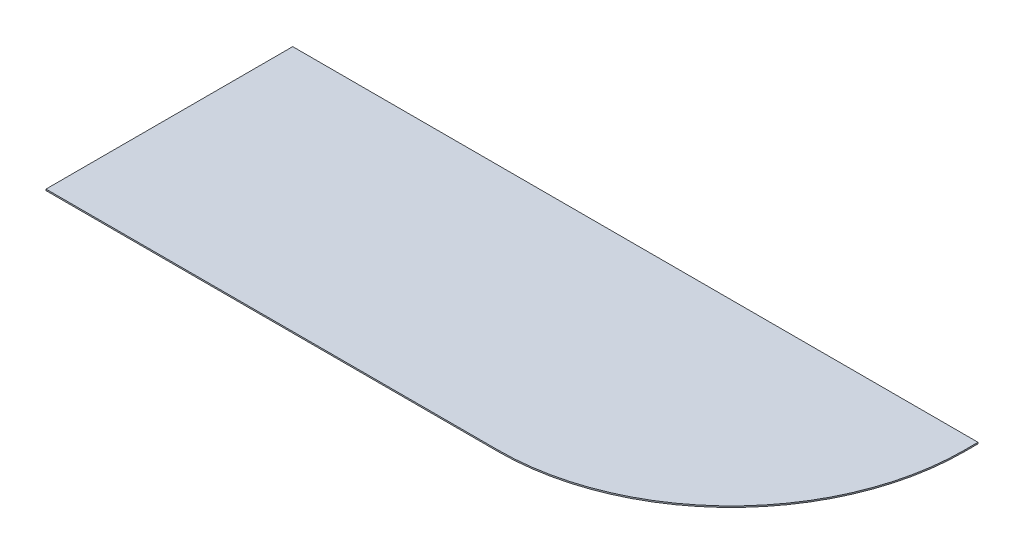
ISO-10303-21;
HEADER;
FILE_DESCRIPTION(('STEP AP214'),'2;1');
FILE_NAME('part.step','',(''),(''),'','','');
FILE_SCHEMA(('AUTOMOTIVE_DESIGN { 1 0 10303 214 1 1 1 1 }'));
ENDSEC;
DATA;
#1=APPLICATION_CONTEXT('core data for automotive mechanical design processes');
#2=APPLICATION_PROTOCOL_DEFINITION('international standard','automotive_design',2000,#1);
#3=PRODUCT_CONTEXT('',#1,'mechanical');
#4=PRODUCT('Part','Part','',(#3));
#5=PRODUCT_RELATED_PRODUCT_CATEGORY('part','',(#4));
#6=PRODUCT_DEFINITION_FORMATION('','',#4);
#7=PRODUCT_DEFINITION_CONTEXT('part definition',#1,'design');
#8=PRODUCT_DEFINITION('design','',#6,#7);
#9=PRODUCT_DEFINITION_SHAPE('','',#8);
#10=(LENGTH_UNIT() NAMED_UNIT(*) SI_UNIT(.MILLI.,.METRE.));
#11=(NAMED_UNIT(*) PLANE_ANGLE_UNIT() SI_UNIT($,.RADIAN.));
#12=(NAMED_UNIT(*) SI_UNIT($,.STERADIAN.) SOLID_ANGLE_UNIT());
#13=UNCERTAINTY_MEASURE_WITH_UNIT(LENGTH_MEASURE(1.E-05),#10,'distance_accuracy_value','');
#14=(GEOMETRIC_REPRESENTATION_CONTEXT(3) GLOBAL_UNCERTAINTY_ASSIGNED_CONTEXT((#13)) GLOBAL_UNIT_ASSIGNED_CONTEXT((#10,
#11,#12)) REPRESENTATION_CONTEXT('',''));
#15=CARTESIAN_POINT('',(0.,0.,0.));
#16=DIRECTION('',(0.,0.,1.));
#17=DIRECTION('',(1.,0.,0.));
#18=AXIS2_PLACEMENT_3D('',#15,#16,#17);
#19=CARTESIAN_POINT('',(0.,1.,0.));
#20=DIRECTION('',(-1.,0.,0.));
#21=DIRECTION('',(0.,0.,1.));
#22=AXIS2_PLACEMENT_3D('',#19,#20,#21);
#23=PLANE('',#22);
#24=DIRECTION('',(0.,0.,-1.));
#25=VECTOR('',#24,1.);
#26=CARTESIAN_POINT('',(0.,0.,0.));
#27=LINE('',#26,#25);
#28=CARTESIAN_POINT('',(0.,0.,9.99999999999879));
#29=VERTEX_POINT('',#28);
#30=CARTESIAN_POINT('',(0.,0.,0.));
#31=VERTEX_POINT('',#30);
#32=EDGE_CURVE('E122',#29,#31,#27,.T.);
#33=ORIENTED_EDGE('',*,*,#32,.T.);
#34=DIRECTION('',(0.,-1.,0.));
#35=VECTOR('',#34,1.);
#36=CARTESIAN_POINT('',(0.,1.,0.));
#37=LINE('',#36,#35);
#38=CARTESIAN_POINT('',(0.,1.,0.));
#39=VERTEX_POINT('',#38);
#40=EDGE_CURVE('E11',#39,#31,#37,.T.);
#41=ORIENTED_EDGE('',*,*,#40,.F.);
#42=DIRECTION('',(0.,0.,-1.));
#43=VECTOR('',#42,1.);
#44=CARTESIAN_POINT('',(0.,1.,0.));
#45=LINE('',#44,#43);
#46=CARTESIAN_POINT('',(0.,1.,9.99999999999879));
#47=VERTEX_POINT('',#46);
#48=EDGE_CURVE('E135',#47,#39,#45,.T.);
#49=ORIENTED_EDGE('',*,*,#48,.F.);
#50=DIRECTION('',(0.,-1.,0.));
#51=VECTOR('',#50,1.);
#52=CARTESIAN_POINT('',(0.,1.,9.99999999999879));
#53=LINE('',#52,#51);
#54=EDGE_CURVE('E118',#47,#29,#53,.T.);
#55=ORIENTED_EDGE('',*,*,#54,.T.);
#56=EDGE_LOOP('',(#33,#41,#49,#55));
#57=FACE_BOUND('',#56,.T.);
#58=ADVANCED_FACE('F43',(#57),#23,.F.);
#59=CARTESIAN_POINT('',(0.,1.,0.));
#60=DIRECTION('',(0.,0.,1.));
#61=DIRECTION('',(1.,0.,0.));
#62=AXIS2_PLACEMENT_3D('',#59,#60,#61);
#63=PLANE('',#62);
#64=DIRECTION('',(-1.,0.,0.));
#65=VECTOR('',#64,1.);
#66=CARTESIAN_POINT('',(0.,0.,0.));
#67=LINE('',#66,#65);
#68=CARTESIAN_POINT('',(-500.,0.,0.));
#69=VERTEX_POINT('',#68);
#70=EDGE_CURVE('E126',#31,#69,#67,.T.);
#71=ORIENTED_EDGE('',*,*,#70,.T.);
#72=DIRECTION('',(0.,-1.,0.));
#73=VECTOR('',#72,1.);
#74=CARTESIAN_POINT('',(-500.,1.,0.));
#75=LINE('',#74,#73);
#76=CARTESIAN_POINT('',(-500.,1.,0.));
#77=VERTEX_POINT('',#76);
#78=EDGE_CURVE('E52',#77,#69,#75,.T.);
#79=ORIENTED_EDGE('',*,*,#78,.F.);
#80=DIRECTION('',(-1.,0.,0.));
#81=VECTOR('',#80,1.);
#82=CARTESIAN_POINT('',(0.,1.,0.));
#83=LINE('',#82,#81);
#84=EDGE_CURVE('E94',#39,#77,#83,.T.);
#85=ORIENTED_EDGE('',*,*,#84,.F.);
#86=ORIENTED_EDGE('',*,*,#40,.T.);
#87=EDGE_LOOP('',(#71,#79,#85,#86));
#88=FACE_BOUND('',#87,.T.);
#89=ADVANCED_FACE('F157',(#88),#63,.F.);
#90=CARTESIAN_POINT('',(-500.,1.,0.));
#91=DIRECTION('',(1.,0.,0.));
#92=DIRECTION('',(0.,0.,-1.));
#93=AXIS2_PLACEMENT_3D('',#90,#91,#92);
#94=PLANE('',#93);
#95=DIRECTION('',(0.,0.,1.));
#96=VECTOR('',#95,1.);
#97=CARTESIAN_POINT('',(-500.,0.,0.));
#98=LINE('',#97,#96);
#99=CARTESIAN_POINT('',(-500.,0.,180.));
#100=VERTEX_POINT('',#99);
#101=EDGE_CURVE('E110',#69,#100,#98,.T.);
#102=ORIENTED_EDGE('',*,*,#101,.T.);
#103=DIRECTION('',(0.,-1.,0.));
#104=VECTOR('',#103,1.);
#105=CARTESIAN_POINT('',(-500.,1.,180.));
#106=LINE('',#105,#104);
#107=CARTESIAN_POINT('',(-500.,1.,180.));
#108=VERTEX_POINT('',#107);
#109=EDGE_CURVE('E107',#108,#100,#106,.T.);
#110=ORIENTED_EDGE('',*,*,#109,.F.);
#111=DIRECTION('',(0.,0.,1.));
#112=VECTOR('',#111,1.);
#113=CARTESIAN_POINT('',(-500.,1.,0.));
#114=LINE('',#113,#112);
#115=EDGE_CURVE('E98',#77,#108,#114,.T.);
#116=ORIENTED_EDGE('',*,*,#115,.F.);
#117=ORIENTED_EDGE('',*,*,#78,.T.);
#118=EDGE_LOOP('',(#102,#110,#116,#117));
#119=FACE_BOUND('',#118,.T.);
#120=ADVANCED_FACE('F108',(#119),#94,.F.);
#121=CARTESIAN_POINT('',(-170.000000000001,1.,180.));
#122=DIRECTION('',(0.,0.,-1.));
#123=DIRECTION('',(-1.,0.,0.));
#124=AXIS2_PLACEMENT_3D('',#121,#122,#123);
#125=PLANE('',#124);
#126=DIRECTION('',(1.,0.,0.));
#127=VECTOR('',#126,1.);
#128=CARTESIAN_POINT('',(-170.000000000001,0.,180.));
#129=LINE('',#128,#127);
#130=CARTESIAN_POINT('',(-170.000000000001,0.,180.));
#131=VERTEX_POINT('',#130);
#132=EDGE_CURVE('E80',#100,#131,#129,.T.);
#133=ORIENTED_EDGE('',*,*,#132,.T.);
#134=DIRECTION('',(0.,-1.,0.));
#135=VECTOR('',#134,1.);
#136=CARTESIAN_POINT('',(-170.000000000001,1.,180.));
#137=LINE('',#136,#135);
#138=CARTESIAN_POINT('',(-170.000000000001,1.,180.));
#139=VERTEX_POINT('',#138);
#140=EDGE_CURVE('E112',#139,#131,#137,.T.);
#141=ORIENTED_EDGE('',*,*,#140,.F.);
#142=DIRECTION('',(1.,0.,0.));
#143=VECTOR('',#142,1.);
#144=CARTESIAN_POINT('',(-170.000000000001,1.,180.));
#145=LINE('',#144,#143);
#146=EDGE_CURVE('E102',#108,#139,#145,.T.);
#147=ORIENTED_EDGE('',*,*,#146,.F.);
#148=ORIENTED_EDGE('',*,*,#109,.T.);
#149=EDGE_LOOP('',(#133,#141,#147,#148));
#150=FACE_BOUND('',#149,.T.);
#151=ADVANCED_FACE('F114',(#150),#125,.F.);
#152=CARTESIAN_POINT('',(-170.,1.,10.));
#153=DIRECTION('',(0.,-1.,0.));
#154=DIRECTION('',(0.,0.,-1.));
#155=AXIS2_PLACEMENT_3D('',#152,#153,#154);
#156=CYLINDRICAL_SURFACE('',#155,170.);
#157=CARTESIAN_POINT('',(-170.,0.,10.));
#158=DIRECTION('',(0.,1.,0.));
#159=DIRECTION('',(0.,0.,-1.));
#160=AXIS2_PLACEMENT_3D('',#157,#158,#159);
#161=CIRCLE('',#160,170.);
#162=EDGE_CURVE('E86',#131,#29,#161,.T.);
#163=ORIENTED_EDGE('',*,*,#162,.T.);
#164=ORIENTED_EDGE('',*,*,#54,.F.);
#165=CARTESIAN_POINT('',(-170.,1.,10.));
#166=DIRECTION('',(0.,1.,0.));
#167=DIRECTION('',(0.,0.,-1.));
#168=AXIS2_PLACEMENT_3D('',#165,#166,#167);
#169=CIRCLE('',#168,170.);
#170=EDGE_CURVE('E60',#139,#47,#169,.T.);
#171=ORIENTED_EDGE('',*,*,#170,.F.);
#172=ORIENTED_EDGE('',*,*,#140,.T.);
#173=EDGE_LOOP('',(#163,#164,#171,#172));
#174=FACE_BOUND('',#173,.T.);
#175=ADVANCED_FACE('F146',(#174),#156,.T.);
#176=CARTESIAN_POINT('',(-170.,1.,10.));
#177=DIRECTION('',(0.,-1.,0.));
#178=DIRECTION('',(0.,0.,-1.));
#179=AXIS2_PLACEMENT_3D('',#176,#177,#178);
#180=PLANE('',#179);
#181=ORIENTED_EDGE('',*,*,#48,.T.);
#182=ORIENTED_EDGE('',*,*,#84,.T.);
#183=ORIENTED_EDGE('',*,*,#115,.T.);
#184=ORIENTED_EDGE('',*,*,#146,.T.);
#185=ORIENTED_EDGE('',*,*,#170,.T.);
#186=EDGE_LOOP('',(#181,#182,#183,#184,#185));
#187=FACE_BOUND('',#186,.T.);
#188=ADVANCED_FACE('F100',(#187),#180,.F.);
#189=CARTESIAN_POINT('',(-170.,0.,10.));
#190=DIRECTION('',(0.,-1.,0.));
#191=DIRECTION('',(0.,0.,-1.));
#192=AXIS2_PLACEMENT_3D('',#189,#190,#191);
#193=PLANE('',#192);
#194=ORIENTED_EDGE('',*,*,#32,.F.);
#195=ORIENTED_EDGE('',*,*,#162,.F.);
#196=ORIENTED_EDGE('',*,*,#132,.F.);
#197=ORIENTED_EDGE('',*,*,#101,.F.);
#198=ORIENTED_EDGE('',*,*,#70,.F.);
#199=EDGE_LOOP('',(#194,#195,#196,#197,#198));
#200=FACE_BOUND('',#199,.T.);
#201=ADVANCED_FACE('F142',(#200),#193,.T.);
#202=CLOSED_SHELL('',(#58,#89,#120,#151,#175,#188,#201));
#203=MANIFOLD_SOLID_BREP('B2',#202);
#204=ADVANCED_BREP_SHAPE_REPRESENTATION('',(#18,#203),#14);
#205=SHAPE_DEFINITION_REPRESENTATION(#9,#204);
ENDSEC;
END-ISO-10303-21;
